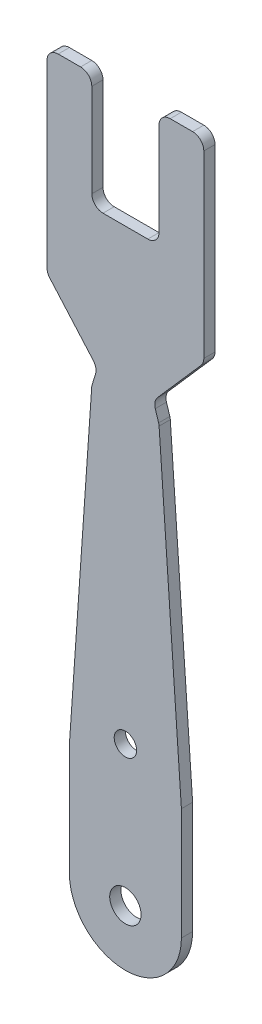
ISO-10303-21;
HEADER;
FILE_DESCRIPTION(('STEP AP214'),'2;1');
FILE_NAME('part.step','',(''),(''),'','','');
FILE_SCHEMA(('AUTOMOTIVE_DESIGN { 1 0 10303 214 1 1 1 1 }'));
ENDSEC;
DATA;
#1=APPLICATION_CONTEXT('core data for automotive mechanical design processes');
#2=APPLICATION_PROTOCOL_DEFINITION('international standard','automotive_design',2000,#1);
#3=PRODUCT_CONTEXT('',#1,'mechanical');
#4=PRODUCT('Part','Part','',(#3));
#5=PRODUCT_RELATED_PRODUCT_CATEGORY('part','',(#4));
#6=PRODUCT_DEFINITION_FORMATION('','',#4);
#7=PRODUCT_DEFINITION_CONTEXT('part definition',#1,'design');
#8=PRODUCT_DEFINITION('design','',#6,#7);
#9=PRODUCT_DEFINITION_SHAPE('','',#8);
#10=(LENGTH_UNIT() NAMED_UNIT(*) SI_UNIT(.MILLI.,.METRE.));
#11=(NAMED_UNIT(*) PLANE_ANGLE_UNIT() SI_UNIT($,.RADIAN.));
#12=(NAMED_UNIT(*) SI_UNIT($,.STERADIAN.) SOLID_ANGLE_UNIT());
#13=UNCERTAINTY_MEASURE_WITH_UNIT(LENGTH_MEASURE(1.E-05),#10,'distance_accuracy_value','');
#14=(GEOMETRIC_REPRESENTATION_CONTEXT(3) GLOBAL_UNCERTAINTY_ASSIGNED_CONTEXT((#13)) GLOBAL_UNIT_ASSIGNED_CONTEXT((#10,
#11,#12)) REPRESENTATION_CONTEXT('',''));
#15=CARTESIAN_POINT('',(0.,0.,0.));
#16=DIRECTION('',(0.,0.,1.));
#17=DIRECTION('',(1.,0.,0.));
#18=AXIS2_PLACEMENT_3D('',#15,#16,#17);
#19=CARTESIAN_POINT('',(48.8276486068912,24.3010241556136,-1.));
#20=DIRECTION('',(0.,0.,1.));
#21=DIRECTION('',(1.,0.,0.));
#22=AXIS2_PLACEMENT_3D('',#19,#20,#21);
#23=CYLINDRICAL_SURFACE('',#22,0.999999999999998);
#24=CARTESIAN_POINT('',(48.8276486068912,24.3010241556136,0.));
#25=DIRECTION('',(0.,0.,-1.));
#26=DIRECTION('',(1.,0.,0.));
#27=AXIS2_PLACEMENT_3D('',#24,#25,#26);
#28=CIRCLE('',#27,0.999999999999998);
#29=CARTESIAN_POINT('',(47.8730692380238,24.0030673994682,0.));
#30=VERTEX_POINT('',#29);
#31=CARTESIAN_POINT('',(48.0755558517128,24.9600814274863,0.));
#32=VERTEX_POINT('',#31);
#33=EDGE_CURVE('E256',#30,#32,#28,.T.);
#34=ORIENTED_EDGE('',*,*,#33,.F.);
#35=DIRECTION('',(0.,0.,1.));
#36=VECTOR('',#35,1.);
#37=CARTESIAN_POINT('',(47.8730692380238,24.0030673994682,-1.));
#38=LINE('',#37,#36);
#39=CARTESIAN_POINT('',(47.8730692380238,24.0030673994682,-1.));
#40=VERTEX_POINT('',#39);
#41=EDGE_CURVE('E11',#40,#30,#38,.T.);
#42=ORIENTED_EDGE('',*,*,#41,.F.);
#43=CARTESIAN_POINT('',(48.8276486068912,24.3010241556136,-1.));
#44=DIRECTION('',(0.,0.,-1.));
#45=DIRECTION('',(1.,0.,0.));
#46=AXIS2_PLACEMENT_3D('',#43,#44,#45);
#47=CIRCLE('',#46,0.999999999999998);
#48=CARTESIAN_POINT('',(48.0755558517128,24.9600814274863,-1.));
#49=VERTEX_POINT('',#48);
#50=EDGE_CURVE('E337',#40,#49,#47,.T.);
#51=ORIENTED_EDGE('',*,*,#50,.T.);
#52=DIRECTION('',(0.,0.,1.));
#53=VECTOR('',#52,1.);
#54=CARTESIAN_POINT('',(48.0755558517128,24.9600814274863,-1.));
#55=LINE('',#54,#53);
#56=EDGE_CURVE('E42',#49,#32,#55,.T.);
#57=ORIENTED_EDGE('',*,*,#56,.T.);
#58=EDGE_LOOP('',(#34,#42,#51,#57));
#59=FACE_BOUND('',#58,.T.);
#60=ADVANCED_FACE('F39',(#59),#23,.F.);
#61=CARTESIAN_POINT('',(47.8730692380238,24.0030673994682,-1.));
#62=DIRECTION('',(0.954579368867396,0.297956756145457,0.));
#63=DIRECTION('',(-0.297956756145457,0.954579368867396,0.));
#64=AXIS2_PLACEMENT_3D('',#61,#62,#63);
#65=PLANE('',#64);
#66=DIRECTION('',(-0.297956756145457,0.954579368867396,0.));
#67=VECTOR('',#66,1.);
#68=CARTESIAN_POINT('',(47.8730692380238,24.0030673994682,0.));
#69=LINE('',#68,#67);
#70=CARTESIAN_POINT('',(48.1711246512862,23.048171957726,0.));
#71=VERTEX_POINT('',#70);
#72=EDGE_CURVE('E335',#71,#30,#69,.T.);
#73=ORIENTED_EDGE('',*,*,#72,.F.);
#74=DIRECTION('',(0.,0.,1.));
#75=VECTOR('',#74,1.);
#76=CARTESIAN_POINT('',(48.1711246512862,23.048171957726,-1.));
#77=LINE('',#76,#75);
#78=CARTESIAN_POINT('',(48.1711246512862,23.048171957726,-1.));
#79=VERTEX_POINT('',#78);
#80=EDGE_CURVE('E48',#79,#71,#77,.T.);
#81=ORIENTED_EDGE('',*,*,#80,.F.);
#82=DIRECTION('',(-0.297956756145457,0.954579368867396,0.));
#83=VECTOR('',#82,1.);
#84=CARTESIAN_POINT('',(47.8730692380238,24.0030673994682,-1.));
#85=LINE('',#84,#83);
#86=EDGE_CURVE('E246',#79,#40,#85,.T.);
#87=ORIENTED_EDGE('',*,*,#86,.T.);
#88=ORIENTED_EDGE('',*,*,#41,.T.);
#89=EDGE_LOOP('',(#73,#81,#87,#88));
#90=FACE_BOUND('',#89,.T.);
#91=ADVANCED_FACE('F389',(#90),#65,.T.);
#92=CARTESIAN_POINT('',(47.2165452824188,22.7502152015805,-1.));
#93=DIRECTION('',(0.,0.,1.));
#94=DIRECTION('',(1.,0.,0.));
#95=AXIS2_PLACEMENT_3D('',#92,#93,#94);
#96=CYLINDRICAL_SURFACE('',#95,0.999999999999996);
#97=CARTESIAN_POINT('',(47.2165452824188,22.7502152015805,0.));
#98=DIRECTION('',(0.,0.,1.));
#99=DIRECTION('',(1.,0.,0.));
#100=AXIS2_PLACEMENT_3D('',#97,#98,#99);
#101=CIRCLE('',#100,0.999999999999996);
#102=CARTESIAN_POINT('',(48.2141256617647,22.8197377644226,0.));
#103=VERTEX_POINT('',#102);
#104=EDGE_CURVE('E233',#103,#71,#101,.T.);
#105=ORIENTED_EDGE('',*,*,#104,.F.);
#106=DIRECTION('',(0.,0.,1.));
#107=VECTOR('',#106,1.);
#108=CARTESIAN_POINT('',(48.2141256617647,22.8197377644226,-1.));
#109=LINE('',#108,#107);
#110=CARTESIAN_POINT('',(48.2141256617647,22.8197377644226,-1.));
#111=VERTEX_POINT('',#110);
#112=EDGE_CURVE('E228',#111,#103,#109,.T.);
#113=ORIENTED_EDGE('',*,*,#112,.F.);
#114=CARTESIAN_POINT('',(47.2165452824188,22.7502152015805,-1.));
#115=DIRECTION('',(0.,0.,1.));
#116=DIRECTION('',(1.,0.,0.));
#117=AXIS2_PLACEMENT_3D('',#114,#115,#116);
#118=CIRCLE('',#117,0.999999999999996);
#119=EDGE_CURVE('E231',#111,#79,#118,.T.);
#120=ORIENTED_EDGE('',*,*,#119,.T.);
#121=ORIENTED_EDGE('',*,*,#80,.T.);
#122=EDGE_LOOP('',(#105,#113,#120,#121));
#123=FACE_BOUND('',#122,.T.);
#124=ADVANCED_FACE('F230',(#123),#96,.T.);
#125=CARTESIAN_POINT('',(50.2059903999995,-5.76156160002383,-1.));
#126=DIRECTION('',(0.997580379345878,0.0695225628421115,0.));
#127=DIRECTION('',(-0.0695225628421115,0.997580379345878,0.));
#128=AXIS2_PLACEMENT_3D('',#125,#126,#127);
#129=PLANE('',#128);
#130=DIRECTION('',(-0.0695225628421115,0.997580379345878,0.));
#131=VECTOR('',#130,1.);
#132=CARTESIAN_POINT('',(50.2059903999995,-5.76156160002383,0.));
#133=LINE('',#132,#131);
#134=CARTESIAN_POINT('',(50.2059903999995,-5.76156160002383,0.));
#135=VERTEX_POINT('',#134);
#136=EDGE_CURVE('E332',#135,#103,#133,.T.);
#137=ORIENTED_EDGE('',*,*,#136,.F.);
#138=DIRECTION('',(0.,0.,1.));
#139=VECTOR('',#138,1.);
#140=CARTESIAN_POINT('',(50.2059903999995,-5.76156160002383,-1.));
#141=LINE('',#140,#139);
#142=CARTESIAN_POINT('',(50.2059903999995,-5.76156160002383,-1.));
#143=VERTEX_POINT('',#142);
#144=EDGE_CURVE('E238',#143,#135,#141,.T.);
#145=ORIENTED_EDGE('',*,*,#144,.F.);
#146=DIRECTION('',(-0.0695225628421115,0.997580379345878,0.));
#147=VECTOR('',#146,1.);
#148=CARTESIAN_POINT('',(50.2059903999995,-5.76156160002383,-1.));
#149=LINE('',#148,#147);
#150=EDGE_CURVE('E244',#143,#111,#149,.T.);
#151=ORIENTED_EDGE('',*,*,#150,.T.);
#152=ORIENTED_EDGE('',*,*,#112,.T.);
#153=EDGE_LOOP('',(#137,#145,#151,#152));
#154=FACE_BOUND('',#153,.T.);
#155=ADVANCED_FACE('F248',(#154),#129,.T.);
#156=CARTESIAN_POINT('',(50.2059903999995,-5.76156160002383,-1.));
#157=DIRECTION('',(1.,0.,0.));
#158=DIRECTION('',(0.,1.,0.));
#159=AXIS2_PLACEMENT_3D('',#156,#157,#158);
#160=PLANE('',#159);
#161=DIRECTION('',(0.,1.,0.));
#162=VECTOR('',#161,1.);
#163=CARTESIAN_POINT('',(50.2059903999995,-5.76156160002383,0.));
#164=LINE('',#163,#162);
#165=CARTESIAN_POINT('',(50.2059903999995,-15.7615616000238,0.));
#166=VERTEX_POINT('',#165);
#167=EDGE_CURVE('E329',#166,#135,#164,.T.);
#168=ORIENTED_EDGE('',*,*,#167,.F.);
#169=DIRECTION('',(0.,0.,1.));
#170=VECTOR('',#169,1.);
#171=CARTESIAN_POINT('',(50.2059903999995,-15.7615616000238,-1.));
#172=LINE('',#171,#170);
#173=CARTESIAN_POINT('',(50.2059903999995,-15.7615616000238,-1.));
#174=VERTEX_POINT('',#173);
#175=EDGE_CURVE('E341',#174,#166,#172,.T.);
#176=ORIENTED_EDGE('',*,*,#175,.F.);
#177=DIRECTION('',(0.,1.,0.));
#178=VECTOR('',#177,1.);
#179=CARTESIAN_POINT('',(50.2059903999995,-5.76156160002383,-1.));
#180=LINE('',#179,#178);
#181=EDGE_CURVE('E249',#174,#143,#180,.T.);
#182=ORIENTED_EDGE('',*,*,#181,.T.);
#183=ORIENTED_EDGE('',*,*,#144,.T.);
#184=EDGE_LOOP('',(#168,#176,#182,#183));
#185=FACE_BOUND('',#184,.T.);
#186=ADVANCED_FACE('F402',(#185),#160,.T.);
#187=CARTESIAN_POINT('',(45.2059903999995,-15.7615616000238,-1.));
#188=DIRECTION('',(0.,0.,1.));
#189=DIRECTION('',(1.,0.,0.));
#190=AXIS2_PLACEMENT_3D('',#187,#188,#189);
#191=CYLINDRICAL_SURFACE('',#190,5.);
#192=CARTESIAN_POINT('',(45.2059903999995,-15.7615616000238,0.));
#193=DIRECTION('',(0.,0.,1.));
#194=DIRECTION('',(1.,0.,0.));
#195=AXIS2_PLACEMENT_3D('',#192,#193,#194);
#196=CIRCLE('',#195,5.);
#197=CARTESIAN_POINT('',(40.2059903999995,-15.7615616000238,0.));
#198=VERTEX_POINT('',#197);
#199=EDGE_CURVE('E326',#198,#166,#196,.T.);
#200=ORIENTED_EDGE('',*,*,#199,.F.);
#201=DIRECTION('',(0.,0.,1.));
#202=VECTOR('',#201,1.);
#203=CARTESIAN_POINT('',(40.2059903999995,-15.7615616000238,-1.));
#204=LINE('',#203,#202);
#205=CARTESIAN_POINT('',(40.2059903999995,-15.7615616000238,-1.));
#206=VERTEX_POINT('',#205);
#207=EDGE_CURVE('E343',#206,#198,#204,.T.);
#208=ORIENTED_EDGE('',*,*,#207,.F.);
#209=CARTESIAN_POINT('',(45.2059903999995,-15.7615616000238,-1.));
#210=DIRECTION('',(0.,0.,1.));
#211=DIRECTION('',(1.,0.,0.));
#212=AXIS2_PLACEMENT_3D('',#209,#210,#211);
#213=CIRCLE('',#212,5.);
#214=EDGE_CURVE('E251',#206,#174,#213,.T.);
#215=ORIENTED_EDGE('',*,*,#214,.T.);
#216=ORIENTED_EDGE('',*,*,#175,.T.);
#217=EDGE_LOOP('',(#200,#208,#215,#216));
#218=FACE_BOUND('',#217,.T.);
#219=ADVANCED_FACE('F405',(#218),#191,.T.);
#220=CARTESIAN_POINT('',(40.2059903999995,-5.76156160002383,-1.));
#221=DIRECTION('',(-1.,0.,0.));
#222=DIRECTION('',(0.,-1.,0.));
#223=AXIS2_PLACEMENT_3D('',#220,#221,#222);
#224=PLANE('',#223);
#225=DIRECTION('',(0.,-1.,0.));
#226=VECTOR('',#225,1.);
#227=CARTESIAN_POINT('',(40.2059903999995,-5.76156160002383,0.));
#228=LINE('',#227,#226);
#229=CARTESIAN_POINT('',(40.2059903999995,-5.76156160002383,0.));
#230=VERTEX_POINT('',#229);
#231=EDGE_CURVE('E323',#230,#198,#228,.T.);
#232=ORIENTED_EDGE('',*,*,#231,.F.);
#233=DIRECTION('',(0.,0.,1.));
#234=VECTOR('',#233,1.);
#235=CARTESIAN_POINT('',(40.2059903999995,-5.76156160002383,-1.));
#236=LINE('',#235,#234);
#237=CARTESIAN_POINT('',(40.2059903999995,-5.76156160002383,-1.));
#238=VERTEX_POINT('',#237);
#239=EDGE_CURVE('E345',#238,#230,#236,.T.);
#240=ORIENTED_EDGE('',*,*,#239,.F.);
#241=DIRECTION('',(0.,-1.,0.));
#242=VECTOR('',#241,1.);
#243=CARTESIAN_POINT('',(40.2059903999995,-5.76156160002383,-1.));
#244=LINE('',#243,#242);
#245=EDGE_CURVE('E591',#238,#206,#244,.T.);
#246=ORIENTED_EDGE('',*,*,#245,.T.);
#247=ORIENTED_EDGE('',*,*,#207,.T.);
#248=EDGE_LOOP('',(#232,#240,#246,#247));
#249=FACE_BOUND('',#248,.T.);
#250=ADVANCED_FACE('F409',(#249),#224,.T.);
#251=CARTESIAN_POINT('',(40.2059903999995,-5.76156160002383,-1.));
#252=DIRECTION('',(-0.997580379345878,0.069522562842112,0.));
#253=DIRECTION('',(-0.069522562842112,-0.997580379345878,0.));
#254=AXIS2_PLACEMENT_3D('',#251,#252,#253);
#255=PLANE('',#254);
#256=DIRECTION('',(-0.069522562842112,-0.997580379345877,0.));
#257=VECTOR('',#256,1.);
#258=CARTESIAN_POINT('',(40.2059903999995,-5.76156160002383,0.));
#259=LINE('',#258,#257);
#260=CARTESIAN_POINT('',(42.1978551382343,22.8197377644226,0.));
#261=VERTEX_POINT('',#260);
#262=EDGE_CURVE('E320',#261,#230,#259,.T.);
#263=ORIENTED_EDGE('',*,*,#262,.F.);
#264=DIRECTION('',(0.,0.,1.));
#265=VECTOR('',#264,1.);
#266=CARTESIAN_POINT('',(42.1978551382343,22.8197377644226,-1.));
#267=LINE('',#266,#265);
#268=CARTESIAN_POINT('',(42.1978551382343,22.8197377644226,-1.));
#269=VERTEX_POINT('',#268);
#270=EDGE_CURVE('E347',#269,#261,#267,.T.);
#271=ORIENTED_EDGE('',*,*,#270,.F.);
#272=DIRECTION('',(-0.069522562842112,-0.997580379345877,0.));
#273=VECTOR('',#272,1.);
#274=CARTESIAN_POINT('',(40.2059903999995,-5.76156160002383,-1.));
#275=LINE('',#274,#273);
#276=EDGE_CURVE('E588',#269,#238,#275,.T.);
#277=ORIENTED_EDGE('',*,*,#276,.T.);
#278=ORIENTED_EDGE('',*,*,#239,.T.);
#279=EDGE_LOOP('',(#263,#271,#277,#278));
#280=FACE_BOUND('',#279,.T.);
#281=ADVANCED_FACE('F413',(#280),#255,.T.);
#282=CARTESIAN_POINT('',(43.1954355175802,22.7502152015805,-1.));
#283=DIRECTION('',(0.,0.,1.));
#284=DIRECTION('',(1.,0.,0.));
#285=AXIS2_PLACEMENT_3D('',#282,#283,#284);
#286=CYLINDRICAL_SURFACE('',#285,0.999999999999996);
#287=CARTESIAN_POINT('',(43.1954355175802,22.7502152015805,0.));
#288=DIRECTION('',(0.,0.,1.));
#289=DIRECTION('',(-1.,0.,0.));
#290=AXIS2_PLACEMENT_3D('',#287,#288,#289);
#291=CIRCLE('',#290,0.999999999999996);
#292=CARTESIAN_POINT('',(42.2408561487128,23.048171957726,0.));
#293=VERTEX_POINT('',#292);
#294=EDGE_CURVE('E317',#293,#261,#291,.T.);
#295=ORIENTED_EDGE('',*,*,#294,.F.);
#296=DIRECTION('',(0.,0.,1.));
#297=VECTOR('',#296,1.);
#298=CARTESIAN_POINT('',(42.2408561487128,23.048171957726,-1.));
#299=LINE('',#298,#297);
#300=CARTESIAN_POINT('',(42.2408561487128,23.048171957726,-1.));
#301=VERTEX_POINT('',#300);
#302=EDGE_CURVE('E349',#301,#293,#299,.T.);
#303=ORIENTED_EDGE('',*,*,#302,.F.);
#304=CARTESIAN_POINT('',(43.1954355175802,22.7502152015805,-1.));
#305=DIRECTION('',(0.,0.,1.));
#306=DIRECTION('',(-1.,0.,0.));
#307=AXIS2_PLACEMENT_3D('',#304,#305,#306);
#308=CIRCLE('',#307,0.999999999999996);
#309=EDGE_CURVE('E585',#301,#269,#308,.T.);
#310=ORIENTED_EDGE('',*,*,#309,.T.);
#311=ORIENTED_EDGE('',*,*,#270,.T.);
#312=EDGE_LOOP('',(#295,#303,#310,#311));
#313=FACE_BOUND('',#312,.T.);
#314=ADVANCED_FACE('F417',(#313),#286,.T.);
#315=CARTESIAN_POINT('',(42.2408561487128,23.048171957726,-1.));
#316=DIRECTION('',(-0.954579368867396,0.297956756145457,0.));
#317=DIRECTION('',(-0.297956756145457,-0.954579368867396,0.));
#318=AXIS2_PLACEMENT_3D('',#315,#316,#317);
#319=PLANE('',#318);
#320=DIRECTION('',(-0.297956756145457,-0.954579368867396,0.));
#321=VECTOR('',#320,1.);
#322=CARTESIAN_POINT('',(42.2408561487128,23.048171957726,0.));
#323=LINE('',#322,#321);
#324=CARTESIAN_POINT('',(42.5389115619752,24.0030673994682,0.));
#325=VERTEX_POINT('',#324);
#326=EDGE_CURVE('E314',#325,#293,#323,.T.);
#327=ORIENTED_EDGE('',*,*,#326,.F.);
#328=DIRECTION('',(0.,0.,1.));
#329=VECTOR('',#328,1.);
#330=CARTESIAN_POINT('',(42.5389115619752,24.0030673994682,-1.));
#331=LINE('',#330,#329);
#332=CARTESIAN_POINT('',(42.5389115619752,24.0030673994682,-1.));
#333=VERTEX_POINT('',#332);
#334=EDGE_CURVE('E351',#333,#325,#331,.T.);
#335=ORIENTED_EDGE('',*,*,#334,.F.);
#336=DIRECTION('',(-0.297956756145457,-0.954579368867396,0.));
#337=VECTOR('',#336,1.);
#338=CARTESIAN_POINT('',(42.2408561487128,23.048171957726,-1.));
#339=LINE('',#338,#337);
#340=EDGE_CURVE('E582',#333,#301,#339,.T.);
#341=ORIENTED_EDGE('',*,*,#340,.T.);
#342=ORIENTED_EDGE('',*,*,#302,.T.);
#343=EDGE_LOOP('',(#327,#335,#341,#342));
#344=FACE_BOUND('',#343,.T.);
#345=ADVANCED_FACE('F421',(#344),#319,.T.);
#346=CARTESIAN_POINT('',(41.5843321931078,24.3010241556136,-1.));
#347=DIRECTION('',(0.,0.,1.));
#348=DIRECTION('',(1.,0.,0.));
#349=AXIS2_PLACEMENT_3D('',#346,#347,#348);
#350=CYLINDRICAL_SURFACE('',#349,0.999999999999997);
#351=CARTESIAN_POINT('',(41.5843321931078,24.3010241556136,0.));
#352=DIRECTION('',(0.,0.,-1.));
#353=DIRECTION('',(1.,0.,0.));
#354=AXIS2_PLACEMENT_3D('',#351,#352,#353);
#355=CIRCLE('',#354,0.999999999999997);
#356=CARTESIAN_POINT('',(42.3364249482862,24.9600814274863,0.));
#357=VERTEX_POINT('',#356);
#358=EDGE_CURVE('E311',#357,#325,#355,.T.);
#359=ORIENTED_EDGE('',*,*,#358,.F.);
#360=DIRECTION('',(0.,0.,1.));
#361=VECTOR('',#360,1.);
#362=CARTESIAN_POINT('',(42.3364249482862,24.9600814274863,-1.));
#363=LINE('',#362,#361);
#364=CARTESIAN_POINT('',(42.3364249482862,24.9600814274863,-1.));
#365=VERTEX_POINT('',#364);
#366=EDGE_CURVE('E353',#365,#357,#363,.T.);
#367=ORIENTED_EDGE('',*,*,#366,.F.);
#368=CARTESIAN_POINT('',(41.5843321931078,24.3010241556136,-1.));
#369=DIRECTION('',(0.,0.,-1.));
#370=DIRECTION('',(1.,0.,0.));
#371=AXIS2_PLACEMENT_3D('',#368,#369,#370);
#372=CIRCLE('',#371,0.999999999999997);
#373=EDGE_CURVE('E579',#365,#333,#372,.T.);
#374=ORIENTED_EDGE('',*,*,#373,.T.);
#375=ORIENTED_EDGE('',*,*,#334,.T.);
#376=EDGE_LOOP('',(#359,#367,#374,#375));
#377=FACE_BOUND('',#376,.T.);
#378=ADVANCED_FACE('F425',(#377),#350,.F.);
#379=CARTESIAN_POINT('',(42.3364249482862,24.9600814274863,-1.));
#380=DIRECTION('',(-0.752092755178346,-0.659057271872669,0.));
#381=DIRECTION('',(0.659057271872669,-0.752092755178346,0.));
#382=AXIS2_PLACEMENT_3D('',#379,#380,#381);
#383=PLANE('',#382);
#384=DIRECTION('',(0.659057271872669,-0.752092755178346,0.));
#385=VECTOR('',#384,1.);
#386=CARTESIAN_POINT('',(42.3364249482862,24.9600814274863,0.));
#387=LINE('',#386,#385);
#388=CARTESIAN_POINT('',(38.4538976448211,29.390683715541,0.));
#389=VERTEX_POINT('',#388);
#390=EDGE_CURVE('E308',#389,#357,#387,.T.);
#391=ORIENTED_EDGE('',*,*,#390,.F.);
#392=DIRECTION('',(0.,0.,1.));
#393=VECTOR('',#392,1.);
#394=CARTESIAN_POINT('',(38.4538976448211,29.390683715541,-1.));
#395=LINE('',#394,#393);
#396=CARTESIAN_POINT('',(38.4538976448211,29.390683715541,-1.));
#397=VERTEX_POINT('',#396);
#398=EDGE_CURVE('E355',#397,#389,#395,.T.);
#399=ORIENTED_EDGE('',*,*,#398,.F.);
#400=DIRECTION('',(0.659057271872669,-0.752092755178346,0.));
#401=VECTOR('',#400,1.);
#402=CARTESIAN_POINT('',(42.3364249482862,24.9600814274863,-1.));
#403=LINE('',#402,#401);
#404=EDGE_CURVE('E576',#397,#365,#403,.T.);
#405=ORIENTED_EDGE('',*,*,#404,.T.);
#406=ORIENTED_EDGE('',*,*,#366,.T.);
#407=EDGE_LOOP('',(#391,#399,#405,#406));
#408=FACE_BOUND('',#407,.T.);
#409=ADVANCED_FACE('F429',(#408),#383,.T.);
#410=CARTESIAN_POINT('',(39.2059903999995,30.0497409874137,-1.));
#411=DIRECTION('',(0.,0.,1.));
#412=DIRECTION('',(1.,0.,0.));
#413=AXIS2_PLACEMENT_3D('',#410,#411,#412);
#414=CYLINDRICAL_SURFACE('',#413,1.);
#415=CARTESIAN_POINT('',(39.2059903999995,30.0497409874137,0.));
#416=DIRECTION('',(0.,0.,1.));
#417=DIRECTION('',(1.,0.,0.));
#418=AXIS2_PLACEMENT_3D('',#415,#416,#417);
#419=CIRCLE('',#418,1.);
#420=CARTESIAN_POINT('',(38.2059903999995,30.0497409874137,0.));
#421=VERTEX_POINT('',#420);
#422=EDGE_CURVE('E305',#421,#389,#419,.T.);
#423=ORIENTED_EDGE('',*,*,#422,.F.);
#424=DIRECTION('',(0.,0.,1.));
#425=VECTOR('',#424,1.);
#426=CARTESIAN_POINT('',(38.2059903999995,30.0497409874137,-1.));
#427=LINE('',#426,#425);
#428=CARTESIAN_POINT('',(38.2059903999995,30.0497409874137,-1.));
#429=VERTEX_POINT('',#428);
#430=EDGE_CURVE('E357',#429,#421,#427,.T.);
#431=ORIENTED_EDGE('',*,*,#430,.F.);
#432=CARTESIAN_POINT('',(39.2059903999995,30.0497409874137,-1.));
#433=DIRECTION('',(0.,0.,1.));
#434=DIRECTION('',(1.,0.,0.));
#435=AXIS2_PLACEMENT_3D('',#432,#433,#434);
#436=CIRCLE('',#435,1.);
#437=EDGE_CURVE('E573',#429,#397,#436,.T.);
#438=ORIENTED_EDGE('',*,*,#437,.T.);
#439=ORIENTED_EDGE('',*,*,#398,.T.);
#440=EDGE_LOOP('',(#423,#431,#438,#439));
#441=FACE_BOUND('',#440,.T.);
#442=ADVANCED_FACE('F433',(#441),#414,.T.);
#443=CARTESIAN_POINT('',(38.2059903999995,30.0497409874137,-1.));
#444=DIRECTION('',(-1.,0.,0.));
#445=DIRECTION('',(0.,0.,1.));
#446=AXIS2_PLACEMENT_3D('',#443,#444,#445);
#447=PLANE('',#446);
#448=DIRECTION('',(0.,-1.,0.));
#449=VECTOR('',#448,1.);
#450=CARTESIAN_POINT('',(38.2059903999995,30.0497409874137,0.));
#451=LINE('',#450,#449);
#452=CARTESIAN_POINT('',(38.2059903999995,46.0852513032582,0.));
#453=VERTEX_POINT('',#452);
#454=EDGE_CURVE('E302',#453,#421,#451,.T.);
#455=ORIENTED_EDGE('',*,*,#454,.F.);
#456=DIRECTION('',(0.,0.,1.));
#457=VECTOR('',#456,1.);
#458=CARTESIAN_POINT('',(38.2059903999995,46.0852513032582,-1.));
#459=LINE('',#458,#457);
#460=CARTESIAN_POINT('',(38.2059903999995,46.0852513032582,-1.));
#461=VERTEX_POINT('',#460);
#462=EDGE_CURVE('E359',#461,#453,#459,.T.);
#463=ORIENTED_EDGE('',*,*,#462,.F.);
#464=DIRECTION('',(0.,-1.,0.));
#465=VECTOR('',#464,1.);
#466=CARTESIAN_POINT('',(38.2059903999995,30.0497409874137,-1.));
#467=LINE('',#466,#465);
#468=EDGE_CURVE('E570',#461,#429,#467,.T.);
#469=ORIENTED_EDGE('',*,*,#468,.T.);
#470=ORIENTED_EDGE('',*,*,#430,.T.);
#471=EDGE_LOOP('',(#455,#463,#469,#470));
#472=FACE_BOUND('',#471,.T.);
#473=ADVANCED_FACE('F437',(#472),#447,.T.);
#474=CARTESIAN_POINT('',(39.2059903999995,46.0852513032582,-1.));
#475=DIRECTION('',(0.,0.,1.));
#476=DIRECTION('',(1.,0.,0.));
#477=AXIS2_PLACEMENT_3D('',#474,#475,#476);
#478=CYLINDRICAL_SURFACE('',#477,1.);
#479=CARTESIAN_POINT('',(39.2059903999995,46.0852513032582,0.));
#480=DIRECTION('',(0.,0.,1.));
#481=DIRECTION('',(1.,0.,0.));
#482=AXIS2_PLACEMENT_3D('',#479,#480,#481);
#483=CIRCLE('',#482,1.);
#484=CARTESIAN_POINT('',(39.2059903999995,47.0852513032582,0.));
#485=VERTEX_POINT('',#484);
#486=EDGE_CURVE('E299',#485,#453,#483,.T.);
#487=ORIENTED_EDGE('',*,*,#486,.F.);
#488=DIRECTION('',(0.,0.,1.));
#489=VECTOR('',#488,1.);
#490=CARTESIAN_POINT('',(39.2059903999995,47.0852513032582,-1.));
#491=LINE('',#490,#489);
#492=CARTESIAN_POINT('',(39.2059903999995,47.0852513032582,-1.));
#493=VERTEX_POINT('',#492);
#494=EDGE_CURVE('E361',#493,#485,#491,.T.);
#495=ORIENTED_EDGE('',*,*,#494,.F.);
#496=CARTESIAN_POINT('',(39.2059903999995,46.0852513032582,-1.));
#497=DIRECTION('',(0.,0.,1.));
#498=DIRECTION('',(1.,0.,0.));
#499=AXIS2_PLACEMENT_3D('',#496,#497,#498);
#500=CIRCLE('',#499,1.);
#501=EDGE_CURVE('E567',#493,#461,#500,.T.);
#502=ORIENTED_EDGE('',*,*,#501,.T.);
#503=ORIENTED_EDGE('',*,*,#462,.T.);
#504=EDGE_LOOP('',(#487,#495,#502,#503));
#505=FACE_BOUND('',#504,.T.);
#506=ADVANCED_FACE('F441',(#505),#478,.T.);
#507=CARTESIAN_POINT('',(39.2059903999995,47.0852513032582,-1.));
#508=DIRECTION('',(0.,1.,0.));
#509=DIRECTION('',(0.,0.,1.));
#510=AXIS2_PLACEMENT_3D('',#507,#508,#509);
#511=PLANE('',#510);
#512=DIRECTION('',(-1.,0.,0.));
#513=VECTOR('',#512,1.);
#514=CARTESIAN_POINT('',(39.2059903999995,47.0852513032582,0.));
#515=LINE('',#514,#513);
#516=CARTESIAN_POINT('',(41.2059903999995,47.0852513032582,0.));
#517=VERTEX_POINT('',#516);
#518=EDGE_CURVE('E296',#517,#485,#515,.T.);
#519=ORIENTED_EDGE('',*,*,#518,.F.);
#520=DIRECTION('',(0.,0.,1.));
#521=VECTOR('',#520,1.);
#522=CARTESIAN_POINT('',(41.2059903999995,47.0852513032582,-1.));
#523=LINE('',#522,#521);
#524=CARTESIAN_POINT('',(41.2059903999995,47.0852513032582,-1.));
#525=VERTEX_POINT('',#524);
#526=EDGE_CURVE('E363',#525,#517,#523,.T.);
#527=ORIENTED_EDGE('',*,*,#526,.F.);
#528=DIRECTION('',(-1.,0.,0.));
#529=VECTOR('',#528,1.);
#530=CARTESIAN_POINT('',(39.2059903999995,47.0852513032582,-1.));
#531=LINE('',#530,#529);
#532=EDGE_CURVE('E564',#525,#493,#531,.T.);
#533=ORIENTED_EDGE('',*,*,#532,.T.);
#534=ORIENTED_EDGE('',*,*,#494,.T.);
#535=EDGE_LOOP('',(#519,#527,#533,#534));
#536=FACE_BOUND('',#535,.T.);
#537=ADVANCED_FACE('F445',(#536),#511,.T.);
#538=CARTESIAN_POINT('',(41.2059903999995,46.0852513032582,-1.));
#539=DIRECTION('',(0.,0.,1.));
#540=DIRECTION('',(1.,0.,0.));
#541=AXIS2_PLACEMENT_3D('',#538,#539,#540);
#542=CYLINDRICAL_SURFACE('',#541,1.);
#543=CARTESIAN_POINT('',(41.2059903999995,46.0852513032582,0.));
#544=DIRECTION('',(0.,0.,1.));
#545=DIRECTION('',(1.,0.,0.));
#546=AXIS2_PLACEMENT_3D('',#543,#544,#545);
#547=CIRCLE('',#546,1.);
#548=CARTESIAN_POINT('',(42.2059903999995,46.0852513032582,0.));
#549=VERTEX_POINT('',#548);
#550=EDGE_CURVE('E293',#549,#517,#547,.T.);
#551=ORIENTED_EDGE('',*,*,#550,.F.);
#552=DIRECTION('',(0.,0.,1.));
#553=VECTOR('',#552,1.);
#554=CARTESIAN_POINT('',(42.2059903999995,46.0852513032582,-1.));
#555=LINE('',#554,#553);
#556=CARTESIAN_POINT('',(42.2059903999995,46.0852513032582,-1.));
#557=VERTEX_POINT('',#556);
#558=EDGE_CURVE('E365',#557,#549,#555,.T.);
#559=ORIENTED_EDGE('',*,*,#558,.F.);
#560=CARTESIAN_POINT('',(41.2059903999995,46.0852513032582,-1.));
#561=DIRECTION('',(0.,0.,1.));
#562=DIRECTION('',(1.,0.,0.));
#563=AXIS2_PLACEMENT_3D('',#560,#561,#562);
#564=CIRCLE('',#563,1.);
#565=EDGE_CURVE('E561',#557,#525,#564,.T.);
#566=ORIENTED_EDGE('',*,*,#565,.T.);
#567=ORIENTED_EDGE('',*,*,#526,.T.);
#568=EDGE_LOOP('',(#551,#559,#566,#567));
#569=FACE_BOUND('',#568,.T.);
#570=ADVANCED_FACE('F449',(#569),#542,.T.);
#571=CARTESIAN_POINT('',(42.2059903999995,46.0852513032582,-1.));
#572=DIRECTION('',(1.,0.,0.));
#573=DIRECTION('',(0.,1.,0.));
#574=AXIS2_PLACEMENT_3D('',#571,#572,#573);
#575=PLANE('',#574);
#576=DIRECTION('',(0.,1.,0.));
#577=VECTOR('',#576,1.);
#578=CARTESIAN_POINT('',(42.2059903999995,46.0852513032582,0.));
#579=LINE('',#578,#577);
#580=CARTESIAN_POINT('',(42.2059903999995,37.7781194382815,0.));
#581=VERTEX_POINT('',#580);
#582=EDGE_CURVE('E290',#581,#549,#579,.T.);
#583=ORIENTED_EDGE('',*,*,#582,.F.);
#584=DIRECTION('',(0.,0.,1.));
#585=VECTOR('',#584,1.);
#586=CARTESIAN_POINT('',(42.2059903999995,37.7781194382815,-1.));
#587=LINE('',#586,#585);
#588=CARTESIAN_POINT('',(42.2059903999995,37.7781194382815,-1.));
#589=VERTEX_POINT('',#588);
#590=EDGE_CURVE('E367',#589,#581,#587,.T.);
#591=ORIENTED_EDGE('',*,*,#590,.F.);
#592=DIRECTION('',(0.,1.,0.));
#593=VECTOR('',#592,1.);
#594=CARTESIAN_POINT('',(42.2059903999995,46.0852513032582,-1.));
#595=LINE('',#594,#593);
#596=EDGE_CURVE('E558',#589,#557,#595,.T.);
#597=ORIENTED_EDGE('',*,*,#596,.T.);
#598=ORIENTED_EDGE('',*,*,#558,.T.);
#599=EDGE_LOOP('',(#583,#591,#597,#598));
#600=FACE_BOUND('',#599,.T.);
#601=ADVANCED_FACE('F453',(#600),#575,.T.);
#602=CARTESIAN_POINT('',(43.2059903999995,37.7781194382815,-1.));
#603=DIRECTION('',(0.,0.,1.));
#604=DIRECTION('',(1.,0.,0.));
#605=AXIS2_PLACEMENT_3D('',#602,#603,#604);
#606=CYLINDRICAL_SURFACE('',#605,1.);
#607=CARTESIAN_POINT('',(43.2059903999995,37.7781194382815,0.));
#608=DIRECTION('',(0.,0.,-1.));
#609=DIRECTION('',(-1.,0.,0.));
#610=AXIS2_PLACEMENT_3D('',#607,#608,#609);
#611=CIRCLE('',#610,1.);
#612=CARTESIAN_POINT('',(43.2059903999995,36.7781194382815,0.));
#613=VERTEX_POINT('',#612);
#614=EDGE_CURVE('E287',#613,#581,#611,.T.);
#615=ORIENTED_EDGE('',*,*,#614,.F.);
#616=DIRECTION('',(0.,0.,1.));
#617=VECTOR('',#616,1.);
#618=CARTESIAN_POINT('',(43.2059903999995,36.7781194382815,-1.));
#619=LINE('',#618,#617);
#620=CARTESIAN_POINT('',(43.2059903999995,36.7781194382815,-1.));
#621=VERTEX_POINT('',#620);
#622=EDGE_CURVE('E369',#621,#613,#619,.T.);
#623=ORIENTED_EDGE('',*,*,#622,.F.);
#624=CARTESIAN_POINT('',(43.2059903999995,37.7781194382815,-1.));
#625=DIRECTION('',(0.,0.,-1.));
#626=DIRECTION('',(-1.,0.,0.));
#627=AXIS2_PLACEMENT_3D('',#624,#625,#626);
#628=CIRCLE('',#627,1.);
#629=EDGE_CURVE('E555',#621,#589,#628,.T.);
#630=ORIENTED_EDGE('',*,*,#629,.T.);
#631=ORIENTED_EDGE('',*,*,#590,.T.);
#632=EDGE_LOOP('',(#615,#623,#630,#631));
#633=FACE_BOUND('',#632,.T.);
#634=ADVANCED_FACE('F457',(#633),#606,.F.);
#635=CARTESIAN_POINT('',(43.2059903999995,36.7781194382815,-1.));
#636=DIRECTION('',(0.,1.,0.));
#637=DIRECTION('',(0.,0.,1.));
#638=AXIS2_PLACEMENT_3D('',#635,#636,#637);
#639=PLANE('',#638);
#640=DIRECTION('',(-1.,0.,0.));
#641=VECTOR('',#640,1.);
#642=CARTESIAN_POINT('',(43.2059903999995,36.7781194382815,0.));
#643=LINE('',#642,#641);
#644=CARTESIAN_POINT('',(47.2059903999995,36.7781194382815,0.));
#645=VERTEX_POINT('',#644);
#646=EDGE_CURVE('E284',#645,#613,#643,.T.);
#647=ORIENTED_EDGE('',*,*,#646,.F.);
#648=DIRECTION('',(0.,0.,1.));
#649=VECTOR('',#648,1.);
#650=CARTESIAN_POINT('',(47.2059903999995,36.7781194382815,-1.));
#651=LINE('',#650,#649);
#652=CARTESIAN_POINT('',(47.2059903999995,36.7781194382815,-1.));
#653=VERTEX_POINT('',#652);
#654=EDGE_CURVE('E371',#653,#645,#651,.T.);
#655=ORIENTED_EDGE('',*,*,#654,.F.);
#656=DIRECTION('',(-1.,0.,0.));
#657=VECTOR('',#656,1.);
#658=CARTESIAN_POINT('',(43.2059903999995,36.7781194382815,-1.));
#659=LINE('',#658,#657);
#660=EDGE_CURVE('E552',#653,#621,#659,.T.);
#661=ORIENTED_EDGE('',*,*,#660,.T.);
#662=ORIENTED_EDGE('',*,*,#622,.T.);
#663=EDGE_LOOP('',(#647,#655,#661,#662));
#664=FACE_BOUND('',#663,.T.);
#665=ADVANCED_FACE('F461',(#664),#639,.T.);
#666=CARTESIAN_POINT('',(47.2059903999995,37.7781194382815,-1.));
#667=DIRECTION('',(0.,0.,1.));
#668=DIRECTION('',(1.,0.,0.));
#669=AXIS2_PLACEMENT_3D('',#666,#667,#668);
#670=CYLINDRICAL_SURFACE('',#669,1.);
#671=CARTESIAN_POINT('',(47.2059903999995,37.7781194382815,0.));
#672=DIRECTION('',(0.,0.,-1.));
#673=DIRECTION('',(-1.,0.,0.));
#674=AXIS2_PLACEMENT_3D('',#671,#672,#673);
#675=CIRCLE('',#674,1.);
#676=CARTESIAN_POINT('',(48.2059903999995,37.7781194382815,0.));
#677=VERTEX_POINT('',#676);
#678=EDGE_CURVE('E281',#677,#645,#675,.T.);
#679=ORIENTED_EDGE('',*,*,#678,.F.);
#680=DIRECTION('',(0.,0.,1.));
#681=VECTOR('',#680,1.);
#682=CARTESIAN_POINT('',(48.2059903999995,37.7781194382815,-1.));
#683=LINE('',#682,#681);
#684=CARTESIAN_POINT('',(48.2059903999995,37.7781194382815,-1.));
#685=VERTEX_POINT('',#684);
#686=EDGE_CURVE('E373',#685,#677,#683,.T.);
#687=ORIENTED_EDGE('',*,*,#686,.F.);
#688=CARTESIAN_POINT('',(47.2059903999995,37.7781194382815,-1.));
#689=DIRECTION('',(0.,0.,-1.));
#690=DIRECTION('',(-1.,0.,0.));
#691=AXIS2_PLACEMENT_3D('',#688,#689,#690);
#692=CIRCLE('',#691,1.);
#693=EDGE_CURVE('E549',#685,#653,#692,.T.);
#694=ORIENTED_EDGE('',*,*,#693,.T.);
#695=ORIENTED_EDGE('',*,*,#654,.T.);
#696=EDGE_LOOP('',(#679,#687,#694,#695));
#697=FACE_BOUND('',#696,.T.);
#698=ADVANCED_FACE('F465',(#697),#670,.F.);
#699=CARTESIAN_POINT('',(48.2059903999995,37.7781194382815,-1.));
#700=DIRECTION('',(-1.,0.,0.));
#701=DIRECTION('',(0.,0.,1.));
#702=AXIS2_PLACEMENT_3D('',#699,#700,#701);
#703=PLANE('',#702);
#704=DIRECTION('',(0.,-1.,0.));
#705=VECTOR('',#704,1.);
#706=CARTESIAN_POINT('',(48.2059903999995,37.7781194382815,0.));
#707=LINE('',#706,#705);
#708=CARTESIAN_POINT('',(48.2059903999995,46.0852513032582,0.));
#709=VERTEX_POINT('',#708);
#710=EDGE_CURVE('E278',#709,#677,#707,.T.);
#711=ORIENTED_EDGE('',*,*,#710,.F.);
#712=DIRECTION('',(0.,0.,1.));
#713=VECTOR('',#712,1.);
#714=CARTESIAN_POINT('',(48.2059903999995,46.0852513032582,-1.));
#715=LINE('',#714,#713);
#716=CARTESIAN_POINT('',(48.2059903999995,46.0852513032582,-1.));
#717=VERTEX_POINT('',#716);
#718=EDGE_CURVE('E375',#717,#709,#715,.T.);
#719=ORIENTED_EDGE('',*,*,#718,.F.);
#720=DIRECTION('',(0.,-1.,0.));
#721=VECTOR('',#720,1.);
#722=CARTESIAN_POINT('',(48.2059903999995,37.7781194382815,-1.));
#723=LINE('',#722,#721);
#724=EDGE_CURVE('E546',#717,#685,#723,.T.);
#725=ORIENTED_EDGE('',*,*,#724,.T.);
#726=ORIENTED_EDGE('',*,*,#686,.T.);
#727=EDGE_LOOP('',(#711,#719,#725,#726));
#728=FACE_BOUND('',#727,.T.);
#729=ADVANCED_FACE('F469',(#728),#703,.T.);
#730=CARTESIAN_POINT('',(49.2059903999995,46.0852513032582,-1.));
#731=DIRECTION('',(0.,0.,1.));
#732=DIRECTION('',(1.,0.,0.));
#733=AXIS2_PLACEMENT_3D('',#730,#731,#732);
#734=CYLINDRICAL_SURFACE('',#733,1.);
#735=CARTESIAN_POINT('',(49.2059903999995,46.0852513032582,0.));
#736=DIRECTION('',(0.,0.,1.));
#737=DIRECTION('',(-1.,0.,0.));
#738=AXIS2_PLACEMENT_3D('',#735,#736,#737);
#739=CIRCLE('',#738,1.);
#740=CARTESIAN_POINT('',(49.2059903999995,47.0852513032582,0.));
#741=VERTEX_POINT('',#740);
#742=EDGE_CURVE('E275',#741,#709,#739,.T.);
#743=ORIENTED_EDGE('',*,*,#742,.F.);
#744=DIRECTION('',(0.,0.,1.));
#745=VECTOR('',#744,1.);
#746=CARTESIAN_POINT('',(49.2059903999995,47.0852513032582,-1.));
#747=LINE('',#746,#745);
#748=CARTESIAN_POINT('',(49.2059903999995,47.0852513032582,-1.));
#749=VERTEX_POINT('',#748);
#750=EDGE_CURVE('E377',#749,#741,#747,.T.);
#751=ORIENTED_EDGE('',*,*,#750,.F.);
#752=CARTESIAN_POINT('',(49.2059903999995,46.0852513032582,-1.));
#753=DIRECTION('',(0.,0.,1.));
#754=DIRECTION('',(-1.,0.,0.));
#755=AXIS2_PLACEMENT_3D('',#752,#753,#754);
#756=CIRCLE('',#755,1.);
#757=EDGE_CURVE('E543',#749,#717,#756,.T.);
#758=ORIENTED_EDGE('',*,*,#757,.T.);
#759=ORIENTED_EDGE('',*,*,#718,.T.);
#760=EDGE_LOOP('',(#743,#751,#758,#759));
#761=FACE_BOUND('',#760,.T.);
#762=ADVANCED_FACE('F473',(#761),#734,.T.);
#763=CARTESIAN_POINT('',(49.2059903999995,47.0852513032582,-1.));
#764=DIRECTION('',(0.,1.,0.));
#765=DIRECTION('',(0.,0.,1.));
#766=AXIS2_PLACEMENT_3D('',#763,#764,#765);
#767=PLANE('',#766);
#768=DIRECTION('',(-1.,0.,0.));
#769=VECTOR('',#768,1.);
#770=CARTESIAN_POINT('',(49.2059903999995,47.0852513032582,0.));
#771=LINE('',#770,#769);
#772=CARTESIAN_POINT('',(51.2059903999995,47.0852513032582,0.));
#773=VERTEX_POINT('',#772);
#774=EDGE_CURVE('E272',#773,#741,#771,.T.);
#775=ORIENTED_EDGE('',*,*,#774,.F.);
#776=DIRECTION('',(0.,0.,1.));
#777=VECTOR('',#776,1.);
#778=CARTESIAN_POINT('',(51.2059903999995,47.0852513032582,-1.));
#779=LINE('',#778,#777);
#780=CARTESIAN_POINT('',(51.2059903999995,47.0852513032582,-1.));
#781=VERTEX_POINT('',#780);
#782=EDGE_CURVE('E379',#781,#773,#779,.T.);
#783=ORIENTED_EDGE('',*,*,#782,.F.);
#784=DIRECTION('',(-1.,0.,0.));
#785=VECTOR('',#784,1.);
#786=CARTESIAN_POINT('',(49.2059903999995,47.0852513032582,-1.));
#787=LINE('',#786,#785);
#788=EDGE_CURVE('E540',#781,#749,#787,.T.);
#789=ORIENTED_EDGE('',*,*,#788,.T.);
#790=ORIENTED_EDGE('',*,*,#750,.T.);
#791=EDGE_LOOP('',(#775,#783,#789,#790));
#792=FACE_BOUND('',#791,.T.);
#793=ADVANCED_FACE('F477',(#792),#767,.T.);
#794=CARTESIAN_POINT('',(51.2059903999995,46.0852513032582,-1.));
#795=DIRECTION('',(0.,0.,1.));
#796=DIRECTION('',(1.,0.,0.));
#797=AXIS2_PLACEMENT_3D('',#794,#795,#796);
#798=CYLINDRICAL_SURFACE('',#797,1.);
#799=CARTESIAN_POINT('',(51.2059903999995,46.0852513032582,0.));
#800=DIRECTION('',(0.,0.,1.));
#801=DIRECTION('',(1.,0.,0.));
#802=AXIS2_PLACEMENT_3D('',#799,#800,#801);
#803=CIRCLE('',#802,1.);
#804=CARTESIAN_POINT('',(52.2059903999995,46.0852513032582,0.));
#805=VERTEX_POINT('',#804);
#806=EDGE_CURVE('E269',#805,#773,#803,.T.);
#807=ORIENTED_EDGE('',*,*,#806,.F.);
#808=DIRECTION('',(0.,0.,1.));
#809=VECTOR('',#808,1.);
#810=CARTESIAN_POINT('',(52.2059903999995,46.0852513032582,-1.));
#811=LINE('',#810,#809);
#812=CARTESIAN_POINT('',(52.2059903999995,46.0852513032582,-1.));
#813=VERTEX_POINT('',#812);
#814=EDGE_CURVE('E381',#813,#805,#811,.T.);
#815=ORIENTED_EDGE('',*,*,#814,.F.);
#816=CARTESIAN_POINT('',(51.2059903999995,46.0852513032582,-1.));
#817=DIRECTION('',(0.,0.,1.));
#818=DIRECTION('',(1.,0.,0.));
#819=AXIS2_PLACEMENT_3D('',#816,#817,#818);
#820=CIRCLE('',#819,1.);
#821=EDGE_CURVE('E537',#813,#781,#820,.T.);
#822=ORIENTED_EDGE('',*,*,#821,.T.);
#823=ORIENTED_EDGE('',*,*,#782,.T.);
#824=EDGE_LOOP('',(#807,#815,#822,#823));
#825=FACE_BOUND('',#824,.T.);
#826=ADVANCED_FACE('F481',(#825),#798,.T.);
#827=CARTESIAN_POINT('',(52.2059903999995,46.0852513032582,-1.));
#828=DIRECTION('',(1.,0.,0.));
#829=DIRECTION('',(0.,1.,0.));
#830=AXIS2_PLACEMENT_3D('',#827,#828,#829);
#831=PLANE('',#830);
#832=DIRECTION('',(0.,1.,0.));
#833=VECTOR('',#832,1.);
#834=CARTESIAN_POINT('',(52.2059903999995,46.0852513032582,0.));
#835=LINE('',#834,#833);
#836=CARTESIAN_POINT('',(52.2059903999995,30.0497409874137,0.));
#837=VERTEX_POINT('',#836);
#838=EDGE_CURVE('E266',#837,#805,#835,.T.);
#839=ORIENTED_EDGE('',*,*,#838,.F.);
#840=DIRECTION('',(0.,0.,1.));
#841=VECTOR('',#840,1.);
#842=CARTESIAN_POINT('',(52.2059903999995,30.0497409874137,-1.));
#843=LINE('',#842,#841);
#844=CARTESIAN_POINT('',(52.2059903999995,30.0497409874137,-1.));
#845=VERTEX_POINT('',#844);
#846=EDGE_CURVE('E383',#845,#837,#843,.T.);
#847=ORIENTED_EDGE('',*,*,#846,.F.);
#848=DIRECTION('',(0.,1.,0.));
#849=VECTOR('',#848,1.);
#850=CARTESIAN_POINT('',(52.2059903999995,46.0852513032582,-1.));
#851=LINE('',#850,#849);
#852=EDGE_CURVE('E534',#845,#813,#851,.T.);
#853=ORIENTED_EDGE('',*,*,#852,.T.);
#854=ORIENTED_EDGE('',*,*,#814,.T.);
#855=EDGE_LOOP('',(#839,#847,#853,#854));
#856=FACE_BOUND('',#855,.T.);
#857=ADVANCED_FACE('F485',(#856),#831,.T.);
#858=CARTESIAN_POINT('',(51.2059903999995,30.0497409874137,-1.));
#859=DIRECTION('',(0.,0.,1.));
#860=DIRECTION('',(1.,0.,0.));
#861=AXIS2_PLACEMENT_3D('',#858,#859,#860);
#862=CYLINDRICAL_SURFACE('',#861,1.);
#863=CARTESIAN_POINT('',(51.2059903999995,30.0497409874137,0.));
#864=DIRECTION('',(0.,0.,1.));
#865=DIRECTION('',(1.,0.,0.));
#866=AXIS2_PLACEMENT_3D('',#863,#864,#865);
#867=CIRCLE('',#866,1.);
#868=CARTESIAN_POINT('',(51.9580831551778,29.390683715541,0.));
#869=VERTEX_POINT('',#868);
#870=EDGE_CURVE('E263',#869,#837,#867,.T.);
#871=ORIENTED_EDGE('',*,*,#870,.F.);
#872=DIRECTION('',(0.,0.,1.));
#873=VECTOR('',#872,1.);
#874=CARTESIAN_POINT('',(51.9580831551778,29.390683715541,-1.));
#875=LINE('',#874,#873);
#876=CARTESIAN_POINT('',(51.9580831551778,29.390683715541,-1.));
#877=VERTEX_POINT('',#876);
#878=EDGE_CURVE('E384',#877,#869,#875,.T.);
#879=ORIENTED_EDGE('',*,*,#878,.F.);
#880=CARTESIAN_POINT('',(51.2059903999995,30.0497409874137,-1.));
#881=DIRECTION('',(0.,0.,1.));
#882=DIRECTION('',(1.,0.,0.));
#883=AXIS2_PLACEMENT_3D('',#880,#881,#882);
#884=CIRCLE('',#883,1.);
#885=EDGE_CURVE('E531',#877,#845,#884,.T.);
#886=ORIENTED_EDGE('',*,*,#885,.T.);
#887=ORIENTED_EDGE('',*,*,#846,.T.);
#888=EDGE_LOOP('',(#871,#879,#886,#887));
#889=FACE_BOUND('',#888,.T.);
#890=ADVANCED_FACE('F489',(#889),#862,.T.);
#891=CARTESIAN_POINT('',(51.9580831551778,29.390683715541,-1.));
#892=DIRECTION('',(0.752092755178345,-0.65905727187267,0.));
#893=DIRECTION('',(0.65905727187267,0.752092755178345,0.));
#894=AXIS2_PLACEMENT_3D('',#891,#892,#893);
#895=PLANE('',#894);
#896=DIRECTION('',(0.65905727187267,0.752092755178345,0.));
#897=VECTOR('',#896,1.);
#898=CARTESIAN_POINT('',(51.9580831551778,29.390683715541,0.));
#899=LINE('',#898,#897);
#900=EDGE_CURVE('E259',#32,#869,#899,.T.);
#901=ORIENTED_EDGE('',*,*,#900,.F.);
#902=ORIENTED_EDGE('',*,*,#56,.F.);
#903=DIRECTION('',(0.65905727187267,0.752092755178345,0.));
#904=VECTOR('',#903,1.);
#905=CARTESIAN_POINT('',(51.9580831551778,29.390683715541,-1.));
#906=LINE('',#905,#904);
#907=EDGE_CURVE('E529',#49,#877,#906,.T.);
#908=ORIENTED_EDGE('',*,*,#907,.T.);
#909=ORIENTED_EDGE('',*,*,#878,.T.);
#910=EDGE_LOOP('',(#901,#902,#908,#909));
#911=FACE_BOUND('',#910,.T.);
#912=ADVANCED_FACE('F386',(#911),#895,.T.);
#913=CARTESIAN_POINT('',(48.8276486068912,24.3010241556136,-1.));
#914=DIRECTION('',(0.,0.,1.));
#915=DIRECTION('',(1.,0.,0.));
#916=AXIS2_PLACEMENT_3D('',#913,#914,#915);
#917=PLANE('',#916);
#918=CARTESIAN_POINT('',(45.2059903999995,-3.26156160002383,-1.));
#919=DIRECTION('',(0.,0.,1.));
#920=DIRECTION('',(1.,0.,0.));
#921=AXIS2_PLACEMENT_3D('',#918,#919,#920);
#922=CIRCLE('',#921,0.9999999999584);
#923=CARTESIAN_POINT('',(46.2059903999579,-3.26156160002383,-1.));
#924=VERTEX_POINT('',#923);
#925=EDGE_CURVE('E516',#924,#924,#922,.T.);
#926=ORIENTED_EDGE('',*,*,#925,.T.);
#927=EDGE_LOOP('',(#926));
#928=FACE_BOUND('',#927,.T.);
#929=CARTESIAN_POINT('',(45.2059903999995,-15.7615616000238,-1.));
#930=DIRECTION('',(0.,0.,1.));
#931=DIRECTION('',(1.,0.,0.));
#932=AXIS2_PLACEMENT_3D('',#929,#930,#931);
#933=CIRCLE('',#932,1.3999999999584);
#934=CARTESIAN_POINT('',(46.6059903999579,-15.7615616000238,-1.));
#935=VERTEX_POINT('',#934);
#936=EDGE_CURVE('E260',#935,#935,#933,.T.);
#937=ORIENTED_EDGE('',*,*,#936,.T.);
#938=EDGE_LOOP('',(#937));
#939=FACE_BOUND('',#938,.T.);
#940=ORIENTED_EDGE('',*,*,#50,.F.);
#941=ORIENTED_EDGE('',*,*,#86,.F.);
#942=ORIENTED_EDGE('',*,*,#119,.F.);
#943=ORIENTED_EDGE('',*,*,#150,.F.);
#944=ORIENTED_EDGE('',*,*,#181,.F.);
#945=ORIENTED_EDGE('',*,*,#214,.F.);
#946=ORIENTED_EDGE('',*,*,#245,.F.);
#947=ORIENTED_EDGE('',*,*,#276,.F.);
#948=ORIENTED_EDGE('',*,*,#309,.F.);
#949=ORIENTED_EDGE('',*,*,#340,.F.);
#950=ORIENTED_EDGE('',*,*,#373,.F.);
#951=ORIENTED_EDGE('',*,*,#404,.F.);
#952=ORIENTED_EDGE('',*,*,#437,.F.);
#953=ORIENTED_EDGE('',*,*,#468,.F.);
#954=ORIENTED_EDGE('',*,*,#501,.F.);
#955=ORIENTED_EDGE('',*,*,#532,.F.);
#956=ORIENTED_EDGE('',*,*,#565,.F.);
#957=ORIENTED_EDGE('',*,*,#596,.F.);
#958=ORIENTED_EDGE('',*,*,#629,.F.);
#959=ORIENTED_EDGE('',*,*,#660,.F.);
#960=ORIENTED_EDGE('',*,*,#693,.F.);
#961=ORIENTED_EDGE('',*,*,#724,.F.);
#962=ORIENTED_EDGE('',*,*,#757,.F.);
#963=ORIENTED_EDGE('',*,*,#788,.F.);
#964=ORIENTED_EDGE('',*,*,#821,.F.);
#965=ORIENTED_EDGE('',*,*,#852,.F.);
#966=ORIENTED_EDGE('',*,*,#885,.F.);
#967=ORIENTED_EDGE('',*,*,#907,.F.);
#968=EDGE_LOOP('',(#940,#941,#942,#943,#944,#945,#946,#947,#948,#949,#950,#951,#952,#953,#954,
#955,#956,#957,#958,#959,#960,#961,#962,#963,#964,#965,#966,#967));
#969=FACE_BOUND('',#968,.T.);
#970=ADVANCED_FACE('F242',(#928,#939,#969),#917,.F.);
#971=CARTESIAN_POINT('',(48.8276486068912,24.3010241556136,0.));
#972=DIRECTION('',(0.,0.,1.));
#973=DIRECTION('',(1.,0.,0.));
#974=AXIS2_PLACEMENT_3D('',#971,#972,#973);
#975=PLANE('',#974);
#976=CARTESIAN_POINT('',(45.2059903999995,-3.26156160002383,0.));
#977=DIRECTION('',(0.,0.,1.));
#978=DIRECTION('',(1.,0.,0.));
#979=AXIS2_PLACEMENT_3D('',#976,#977,#978);
#980=CIRCLE('',#979,0.9999999999584);
#981=CARTESIAN_POINT('',(46.2059903999579,-3.26156160002383,0.));
#982=VERTEX_POINT('',#981);
#983=EDGE_CURVE('E519',#982,#982,#980,.T.);
#984=ORIENTED_EDGE('',*,*,#983,.F.);
#985=EDGE_LOOP('',(#984));
#986=FACE_BOUND('',#985,.T.);
#987=CARTESIAN_POINT('',(45.2059903999995,-15.7615616000238,0.));
#988=DIRECTION('',(0.,0.,1.));
#989=DIRECTION('',(1.,0.,0.));
#990=AXIS2_PLACEMENT_3D('',#987,#988,#989);
#991=CIRCLE('',#990,1.3999999999584);
#992=CARTESIAN_POINT('',(46.6059903999579,-15.7615616000238,0.));
#993=VERTEX_POINT('',#992);
#994=EDGE_CURVE('E521',#993,#993,#991,.T.);
#995=ORIENTED_EDGE('',*,*,#994,.F.);
#996=EDGE_LOOP('',(#995));
#997=FACE_BOUND('',#996,.T.);
#998=ORIENTED_EDGE('',*,*,#33,.T.);
#999=ORIENTED_EDGE('',*,*,#900,.T.);
#1000=ORIENTED_EDGE('',*,*,#870,.T.);
#1001=ORIENTED_EDGE('',*,*,#838,.T.);
#1002=ORIENTED_EDGE('',*,*,#806,.T.);
#1003=ORIENTED_EDGE('',*,*,#774,.T.);
#1004=ORIENTED_EDGE('',*,*,#742,.T.);
#1005=ORIENTED_EDGE('',*,*,#710,.T.);
#1006=ORIENTED_EDGE('',*,*,#678,.T.);
#1007=ORIENTED_EDGE('',*,*,#646,.T.);
#1008=ORIENTED_EDGE('',*,*,#614,.T.);
#1009=ORIENTED_EDGE('',*,*,#582,.T.);
#1010=ORIENTED_EDGE('',*,*,#550,.T.);
#1011=ORIENTED_EDGE('',*,*,#518,.T.);
#1012=ORIENTED_EDGE('',*,*,#486,.T.);
#1013=ORIENTED_EDGE('',*,*,#454,.T.);
#1014=ORIENTED_EDGE('',*,*,#422,.T.);
#1015=ORIENTED_EDGE('',*,*,#390,.T.);
#1016=ORIENTED_EDGE('',*,*,#358,.T.);
#1017=ORIENTED_EDGE('',*,*,#326,.T.);
#1018=ORIENTED_EDGE('',*,*,#294,.T.);
#1019=ORIENTED_EDGE('',*,*,#262,.T.);
#1020=ORIENTED_EDGE('',*,*,#231,.T.);
#1021=ORIENTED_EDGE('',*,*,#199,.T.);
#1022=ORIENTED_EDGE('',*,*,#167,.T.);
#1023=ORIENTED_EDGE('',*,*,#136,.T.);
#1024=ORIENTED_EDGE('',*,*,#104,.T.);
#1025=ORIENTED_EDGE('',*,*,#72,.T.);
#1026=EDGE_LOOP('',(#998,#999,#1000,#1001,#1002,#1003,#1004,#1005,#1006,#1007,#1008,#1009,#1010,
#1011,#1012,#1013,#1014,#1015,#1016,#1017,#1018,#1019,#1020,#1021,#1022,#1023,#1024,#1025));
#1027=FACE_BOUND('',#1026,.T.);
#1028=ADVANCED_FACE('F388',(#986,#997,#1027),#975,.T.);
#1029=CARTESIAN_POINT('',(45.2059903999995,-15.7615616000238,-1.));
#1030=DIRECTION('',(0.,0.,1.));
#1031=DIRECTION('',(1.,0.,0.));
#1032=AXIS2_PLACEMENT_3D('',#1029,#1030,#1031);
#1033=CYLINDRICAL_SURFACE('',#1032,1.3999999999584);
#1034=ORIENTED_EDGE('',*,*,#936,.F.);
#1035=EDGE_LOOP('',(#1034));
#1036=FACE_BOUND('',#1035,.T.);
#1037=ORIENTED_EDGE('',*,*,#994,.T.);
#1038=EDGE_LOOP('',(#1037));
#1039=FACE_BOUND('',#1038,.T.);
#1040=ADVANCED_FACE('F501',(#1036,#1039),#1033,.F.);
#1041=CARTESIAN_POINT('',(45.2059903999995,-3.26156160002383,-1.));
#1042=DIRECTION('',(0.,0.,1.));
#1043=DIRECTION('',(1.,0.,0.));
#1044=AXIS2_PLACEMENT_3D('',#1041,#1042,#1043);
#1045=CYLINDRICAL_SURFACE('',#1044,0.9999999999584);
#1046=ORIENTED_EDGE('',*,*,#925,.F.);
#1047=EDGE_LOOP('',(#1046));
#1048=FACE_BOUND('',#1047,.T.);
#1049=ORIENTED_EDGE('',*,*,#983,.T.);
#1050=EDGE_LOOP('',(#1049));
#1051=FACE_BOUND('',#1050,.T.);
#1052=ADVANCED_FACE('F508',(#1048,#1051),#1045,.F.);
#1053=CLOSED_SHELL('',(#60,#91,#124,#155,#186,#219,#250,#281,#314,#345,#378,#409,#442,#473,#506,
#537,#570,#601,#634,#665,#698,#729,#762,#793,#826,#857,#890,#912,#970,#1028,#1040,#1052));
#1054=MANIFOLD_SOLID_BREP('B2',#1053);
#1055=ADVANCED_BREP_SHAPE_REPRESENTATION('',(#18,#1054),#14);
#1056=SHAPE_DEFINITION_REPRESENTATION(#9,#1055);
ENDSEC;
END-ISO-10303-21;
